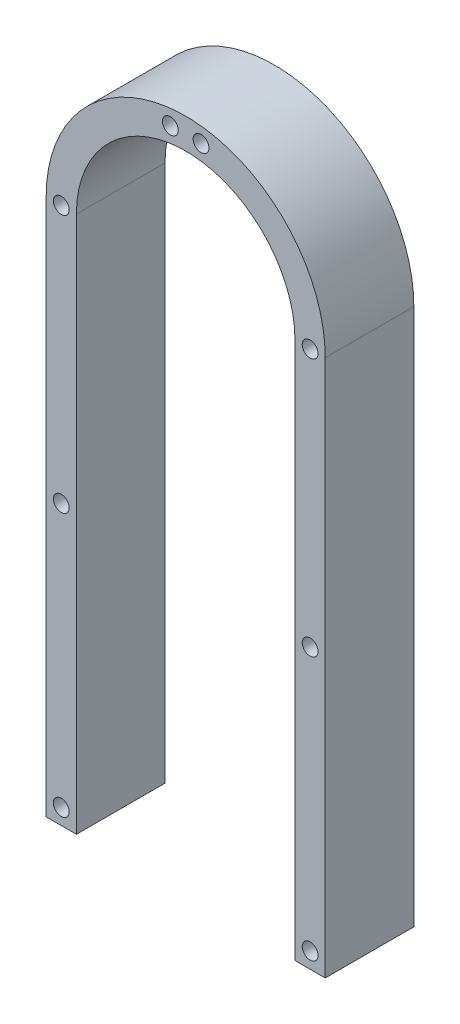
ISO-10303-21;
HEADER;
FILE_DESCRIPTION(('STEP AP214'),'2;1');
FILE_NAME('part.step','',(''),(''),'','','');
FILE_SCHEMA(('AUTOMOTIVE_DESIGN { 1 0 10303 214 1 1 1 1 }'));
ENDSEC;
DATA;
#1=APPLICATION_CONTEXT('core data for automotive mechanical design processes');
#2=APPLICATION_PROTOCOL_DEFINITION('international standard','automotive_design',2000,#1);
#3=PRODUCT_CONTEXT('',#1,'mechanical');
#4=PRODUCT('Part','Part','',(#3));
#5=PRODUCT_RELATED_PRODUCT_CATEGORY('part','',(#4));
#6=PRODUCT_DEFINITION_FORMATION('','',#4);
#7=PRODUCT_DEFINITION_CONTEXT('part definition',#1,'design');
#8=PRODUCT_DEFINITION('design','',#6,#7);
#9=PRODUCT_DEFINITION_SHAPE('','',#8);
#10=(LENGTH_UNIT() NAMED_UNIT(*) SI_UNIT(.MILLI.,.METRE.));
#11=(NAMED_UNIT(*) PLANE_ANGLE_UNIT() SI_UNIT($,.RADIAN.));
#12=(NAMED_UNIT(*) SI_UNIT($,.STERADIAN.) SOLID_ANGLE_UNIT());
#13=UNCERTAINTY_MEASURE_WITH_UNIT(LENGTH_MEASURE(1.E-05),#10,'distance_accuracy_value','');
#14=(GEOMETRIC_REPRESENTATION_CONTEXT(3) GLOBAL_UNCERTAINTY_ASSIGNED_CONTEXT((#13)) GLOBAL_UNIT_ASSIGNED_CONTEXT((#10,
#11,#12)) REPRESENTATION_CONTEXT('',''));
#15=CARTESIAN_POINT('',(0.,0.,0.));
#16=DIRECTION('',(0.,0.,1.));
#17=DIRECTION('',(1.,0.,0.));
#18=AXIS2_PLACEMENT_3D('',#15,#16,#17);
#19=CARTESIAN_POINT('',(-149.085368150531,-18.7891941834329,19.05));
#20=DIRECTION('',(0.,0.,1.));
#21=DIRECTION('',(1.,0.,0.));
#22=AXIS2_PLACEMENT_3D('',#19,#20,#21);
#23=PLANE('',#22);
#24=DIRECTION('',(-1.,0.,0.));
#25=VECTOR('',#24,1.);
#26=CARTESIAN_POINT('',(-149.085368150531,96.6995702810626,19.05));
#27=LINE('',#26,#25);
#28=CARTESIAN_POINT('',(-119.085368150531,96.6995702810626,19.05));
#29=VERTEX_POINT('',#28);
#30=CARTESIAN_POINT('',(-125.585368150531,96.6995702810626,19.05));
#31=VERTEX_POINT('',#30);
#32=EDGE_CURVE('E50',#29,#31,#27,.T.);
#33=ORIENTED_EDGE('',*,*,#32,.F.);
#34=DIRECTION('',(0.,1.,0.));
#35=VECTOR('',#34,1.);
#36=CARTESIAN_POINT('',(-119.085368150531,-18.7891941834329,19.05));
#37=LINE('',#36,#35);
#38=CARTESIAN_POINT('',(-119.085368150531,212.188334745558,19.05));
#39=VERTEX_POINT('',#38);
#40=EDGE_CURVE('E110',#29,#39,#37,.T.);
#41=ORIENTED_EDGE('',*,*,#40,.T.);
#42=CARTESIAN_POINT('',(-149.085368150531,212.188334745558,19.05));
#43=DIRECTION('',(0.,0.,1.));
#44=DIRECTION('',(1.,0.,0.));
#45=AXIS2_PLACEMENT_3D('',#42,#43,#44);
#46=CIRCLE('',#45,30.);
#47=CARTESIAN_POINT('',(-179.085368150531,212.188334745558,19.05));
#48=VERTEX_POINT('',#47);
#49=EDGE_CURVE('E118',#39,#48,#46,.T.);
#50=ORIENTED_EDGE('',*,*,#49,.T.);
#51=DIRECTION('',(0.,-1.,0.));
#52=VECTOR('',#51,1.);
#53=CARTESIAN_POINT('',(-179.085368150531,-18.7891941834329,19.05));
#54=LINE('',#53,#52);
#55=CARTESIAN_POINT('',(-179.085368150531,96.6995702810626,19.05));
#56=VERTEX_POINT('',#55);
#57=EDGE_CURVE('E121',#48,#56,#54,.T.);
#58=ORIENTED_EDGE('',*,*,#57,.T.);
#59=CARTESIAN_POINT('',(-172.585368150531,96.6995702810626,19.05));
#60=VERTEX_POINT('',#59);
#61=EDGE_CURVE('E114',#60,#56,#27,.T.);
#62=ORIENTED_EDGE('',*,*,#61,.F.);
#63=DIRECTION('',(0.,-1.,0.));
#64=VECTOR('',#63,1.);
#65=CARTESIAN_POINT('',(-172.585368150531,-18.7891941834329,19.05));
#66=LINE('',#65,#64);
#67=CARTESIAN_POINT('',(-172.585368150531,212.188334745558,19.05));
#68=VERTEX_POINT('',#67);
#69=EDGE_CURVE('E152',#68,#60,#66,.T.);
#70=ORIENTED_EDGE('',*,*,#69,.F.);
#71=CARTESIAN_POINT('',(-149.085368150531,212.188334745558,19.05));
#72=DIRECTION('',(0.,0.,1.));
#73=DIRECTION('',(1.,0.,0.));
#74=AXIS2_PLACEMENT_3D('',#71,#72,#73);
#75=CIRCLE('',#74,23.5);
#76=CARTESIAN_POINT('',(-125.585368150531,212.188334745558,19.05));
#77=VERTEX_POINT('',#76);
#78=EDGE_CURVE('E158',#77,#68,#75,.T.);
#79=ORIENTED_EDGE('',*,*,#78,.F.);
#80=DIRECTION('',(0.,1.,0.));
#81=VECTOR('',#80,1.);
#82=CARTESIAN_POINT('',(-125.585368150531,-18.7891941834329,19.05));
#83=LINE('',#82,#81);
#84=EDGE_CURVE('E113',#31,#77,#83,.T.);
#85=ORIENTED_EDGE('',*,*,#84,.F.);
#86=EDGE_LOOP('',(#33,#41,#50,#58,#62,#70,#79,#85));
#87=FACE_BOUND('',#86,.T.);
#88=CARTESIAN_POINT('',(-122.335368150531,100.099570281063,19.05));
#89=DIRECTION('',(0.,0.,1.));
#90=DIRECTION('',(1.,0.,0.));
#91=AXIS2_PLACEMENT_3D('',#88,#89,#90);
#92=CIRCLE('',#91,1.7);
#93=CARTESIAN_POINT('',(-120.635368150531,100.099570281063,19.05));
#94=VERTEX_POINT('',#93);
#95=EDGE_CURVE('E104',#94,#94,#92,.T.);
#96=ORIENTED_EDGE('',*,*,#95,.F.);
#97=EDGE_LOOP('',(#96));
#98=FACE_BOUND('',#97,.T.);
#99=CARTESIAN_POINT('',(-152.385368150531,238.734002942083,19.05));
#100=DIRECTION('',(0.,0.,1.));
#101=DIRECTION('',(1.,0.,0.));
#102=AXIS2_PLACEMENT_3D('',#99,#100,#101);
#103=CIRCLE('',#102,1.70000000000001);
#104=CARTESIAN_POINT('',(-150.685368150531,238.734002942083,19.05));
#105=VERTEX_POINT('',#104);
#106=EDGE_CURVE('E210',#105,#105,#103,.T.);
#107=ORIENTED_EDGE('',*,*,#106,.F.);
#108=EDGE_LOOP('',(#107));
#109=FACE_BOUND('',#108,.T.);
#110=CARTESIAN_POINT('',(-122.335368150531,156.699570281063,19.05));
#111=DIRECTION('',(0.,0.,1.));
#112=DIRECTION('',(1.,0.,0.));
#113=AXIS2_PLACEMENT_3D('',#110,#111,#112);
#114=CIRCLE('',#113,1.7);
#115=CARTESIAN_POINT('',(-120.635368150531,156.699570281063,19.05));
#116=VERTEX_POINT('',#115);
#117=EDGE_CURVE('E204',#116,#116,#114,.T.);
#118=ORIENTED_EDGE('',*,*,#117,.F.);
#119=EDGE_LOOP('',(#118));
#120=FACE_BOUND('',#119,.T.);
#121=CARTESIAN_POINT('',(-175.835368150531,156.699570281063,19.05));
#122=DIRECTION('',(0.,0.,1.));
#123=DIRECTION('',(1.,0.,0.));
#124=AXIS2_PLACEMENT_3D('',#121,#122,#123);
#125=CIRCLE('',#124,1.70000000000001);
#126=CARTESIAN_POINT('',(-174.135368150531,156.699570281063,19.05));
#127=VERTEX_POINT('',#126);
#128=EDGE_CURVE('E198',#127,#127,#125,.T.);
#129=ORIENTED_EDGE('',*,*,#128,.F.);
#130=EDGE_LOOP('',(#129));
#131=FACE_BOUND('',#130,.T.);
#132=CARTESIAN_POINT('',(-175.835368150531,100.099570281063,19.05));
#133=DIRECTION('',(0.,0.,1.));
#134=DIRECTION('',(1.,0.,0.));
#135=AXIS2_PLACEMENT_3D('',#132,#133,#134);
#136=CIRCLE('',#135,1.70000000000001);
#137=CARTESIAN_POINT('',(-174.135368150531,100.099570281063,19.05));
#138=VERTEX_POINT('',#137);
#139=EDGE_CURVE('E192',#138,#138,#136,.T.);
#140=ORIENTED_EDGE('',*,*,#139,.F.);
#141=EDGE_LOOP('',(#140));
#142=FACE_BOUND('',#141,.T.);
#143=CARTESIAN_POINT('',(-175.835368150529,212.188334745556,19.05));
#144=DIRECTION('',(0.,0.,1.));
#145=DIRECTION('',(1.,0.,0.));
#146=AXIS2_PLACEMENT_3D('',#143,#144,#145);
#147=CIRCLE('',#146,1.70000000000001);
#148=CARTESIAN_POINT('',(-174.135368150529,212.188334745556,19.05));
#149=VERTEX_POINT('',#148);
#150=EDGE_CURVE('E186',#149,#149,#147,.T.);
#151=ORIENTED_EDGE('',*,*,#150,.F.);
#152=EDGE_LOOP('',(#151));
#153=FACE_BOUND('',#152,.T.);
#154=CARTESIAN_POINT('',(-122.335368150529,212.18833474556,19.05));
#155=DIRECTION('',(0.,0.,1.));
#156=DIRECTION('',(1.,0.,0.));
#157=AXIS2_PLACEMENT_3D('',#154,#155,#156);
#158=CIRCLE('',#157,1.7);
#159=CARTESIAN_POINT('',(-120.635368150529,212.18833474556,19.05));
#160=VERTEX_POINT('',#159);
#161=EDGE_CURVE('E180',#160,#160,#158,.T.);
#162=ORIENTED_EDGE('',*,*,#161,.F.);
#163=EDGE_LOOP('',(#162));
#164=FACE_BOUND('',#163,.T.);
#165=CARTESIAN_POINT('',(-145.785368150531,238.734002942083,19.05));
#166=DIRECTION('',(0.,0.,1.));
#167=DIRECTION('',(1.,0.,0.));
#168=AXIS2_PLACEMENT_3D('',#165,#166,#167);
#169=CIRCLE('',#168,1.70000000000001);
#170=CARTESIAN_POINT('',(-144.085368150531,238.734002942083,19.05));
#171=VERTEX_POINT('',#170);
#172=EDGE_CURVE('E174',#171,#171,#169,.T.);
#173=ORIENTED_EDGE('',*,*,#172,.F.);
#174=EDGE_LOOP('',(#173));
#175=FACE_BOUND('',#174,.T.);
#176=ADVANCED_FACE('F35',(#87,#98,#109,#120,#131,#142,#153,#164,#175),#23,.T.);
#177=CARTESIAN_POINT('',(-149.085368150531,-18.7891941834329,0.));
#178=DIRECTION('',(0.,0.,1.));
#179=DIRECTION('',(1.,0.,0.));
#180=AXIS2_PLACEMENT_3D('',#177,#178,#179);
#181=PLANE('',#180);
#182=CARTESIAN_POINT('',(-122.335368150531,100.099570281063,0.));
#183=DIRECTION('',(0.,0.,1.));
#184=DIRECTION('',(1.,0.,0.));
#185=AXIS2_PLACEMENT_3D('',#182,#183,#184);
#186=CIRCLE('',#185,1.7);
#187=CARTESIAN_POINT('',(-120.635368150531,100.099570281063,0.));
#188=VERTEX_POINT('',#187);
#189=EDGE_CURVE('E213',#188,#188,#186,.T.);
#190=ORIENTED_EDGE('',*,*,#189,.T.);
#191=EDGE_LOOP('',(#190));
#192=FACE_BOUND('',#191,.T.);
#193=CARTESIAN_POINT('',(-152.385368150531,238.734002942083,0.));
#194=DIRECTION('',(0.,0.,1.));
#195=DIRECTION('',(1.,0.,0.));
#196=AXIS2_PLACEMENT_3D('',#193,#194,#195);
#197=CIRCLE('',#196,1.70000000000001);
#198=CARTESIAN_POINT('',(-150.685368150531,238.734002942083,0.));
#199=VERTEX_POINT('',#198);
#200=EDGE_CURVE('E207',#199,#199,#197,.T.);
#201=ORIENTED_EDGE('',*,*,#200,.T.);
#202=EDGE_LOOP('',(#201));
#203=FACE_BOUND('',#202,.T.);
#204=CARTESIAN_POINT('',(-122.335368150531,156.699570281063,0.));
#205=DIRECTION('',(0.,0.,1.));
#206=DIRECTION('',(1.,0.,0.));
#207=AXIS2_PLACEMENT_3D('',#204,#205,#206);
#208=CIRCLE('',#207,1.7);
#209=CARTESIAN_POINT('',(-120.635368150531,156.699570281063,0.));
#210=VERTEX_POINT('',#209);
#211=EDGE_CURVE('E201',#210,#210,#208,.T.);
#212=ORIENTED_EDGE('',*,*,#211,.T.);
#213=EDGE_LOOP('',(#212));
#214=FACE_BOUND('',#213,.T.);
#215=CARTESIAN_POINT('',(-175.835368150531,156.699570281063,0.));
#216=DIRECTION('',(0.,0.,1.));
#217=DIRECTION('',(1.,0.,0.));
#218=AXIS2_PLACEMENT_3D('',#215,#216,#217);
#219=CIRCLE('',#218,1.70000000000001);
#220=CARTESIAN_POINT('',(-174.135368150531,156.699570281063,0.));
#221=VERTEX_POINT('',#220);
#222=EDGE_CURVE('E195',#221,#221,#219,.T.);
#223=ORIENTED_EDGE('',*,*,#222,.T.);
#224=EDGE_LOOP('',(#223));
#225=FACE_BOUND('',#224,.T.);
#226=CARTESIAN_POINT('',(-175.835368150531,100.099570281063,0.));
#227=DIRECTION('',(0.,0.,1.));
#228=DIRECTION('',(1.,0.,0.));
#229=AXIS2_PLACEMENT_3D('',#226,#227,#228);
#230=CIRCLE('',#229,1.70000000000001);
#231=CARTESIAN_POINT('',(-174.135368150531,100.099570281063,0.));
#232=VERTEX_POINT('',#231);
#233=EDGE_CURVE('E189',#232,#232,#230,.T.);
#234=ORIENTED_EDGE('',*,*,#233,.T.);
#235=EDGE_LOOP('',(#234));
#236=FACE_BOUND('',#235,.T.);
#237=CARTESIAN_POINT('',(-175.835368150529,212.188334745556,0.));
#238=DIRECTION('',(0.,0.,1.));
#239=DIRECTION('',(1.,0.,0.));
#240=AXIS2_PLACEMENT_3D('',#237,#238,#239);
#241=CIRCLE('',#240,1.70000000000001);
#242=CARTESIAN_POINT('',(-174.135368150529,212.188334745556,0.));
#243=VERTEX_POINT('',#242);
#244=EDGE_CURVE('E183',#243,#243,#241,.T.);
#245=ORIENTED_EDGE('',*,*,#244,.T.);
#246=EDGE_LOOP('',(#245));
#247=FACE_BOUND('',#246,.T.);
#248=CARTESIAN_POINT('',(-122.335368150529,212.18833474556,0.));
#249=DIRECTION('',(0.,0.,1.));
#250=DIRECTION('',(1.,0.,0.));
#251=AXIS2_PLACEMENT_3D('',#248,#249,#250);
#252=CIRCLE('',#251,1.7);
#253=CARTESIAN_POINT('',(-120.635368150529,212.18833474556,0.));
#254=VERTEX_POINT('',#253);
#255=EDGE_CURVE('E177',#254,#254,#252,.T.);
#256=ORIENTED_EDGE('',*,*,#255,.T.);
#257=EDGE_LOOP('',(#256));
#258=FACE_BOUND('',#257,.T.);
#259=CARTESIAN_POINT('',(-145.785368150531,238.734002942083,0.));
#260=DIRECTION('',(0.,0.,1.));
#261=DIRECTION('',(1.,0.,0.));
#262=AXIS2_PLACEMENT_3D('',#259,#260,#261);
#263=CIRCLE('',#262,1.70000000000001);
#264=CARTESIAN_POINT('',(-144.085368150531,238.734002942083,0.));
#265=VERTEX_POINT('',#264);
#266=EDGE_CURVE('E166',#265,#265,#263,.T.);
#267=ORIENTED_EDGE('',*,*,#266,.T.);
#268=EDGE_LOOP('',(#267));
#269=FACE_BOUND('',#268,.T.);
#270=DIRECTION('',(0.,1.,0.));
#271=VECTOR('',#270,1.);
#272=CARTESIAN_POINT('',(-119.085368150531,-18.7891941834329,0.));
#273=LINE('',#272,#271);
#274=CARTESIAN_POINT('',(-119.085368150531,96.6995702810626,0.));
#275=VERTEX_POINT('',#274);
#276=CARTESIAN_POINT('',(-119.085368150531,212.188334745558,0.));
#277=VERTEX_POINT('',#276);
#278=EDGE_CURVE('E133',#275,#277,#273,.T.);
#279=ORIENTED_EDGE('',*,*,#278,.F.);
#280=DIRECTION('',(-1.,0.,0.));
#281=VECTOR('',#280,1.);
#282=CARTESIAN_POINT('',(-149.085368150531,96.6995702810626,0.));
#283=LINE('',#282,#281);
#284=CARTESIAN_POINT('',(-125.585368150531,96.6995702810626,0.));
#285=VERTEX_POINT('',#284);
#286=EDGE_CURVE('E100',#275,#285,#283,.T.);
#287=ORIENTED_EDGE('',*,*,#286,.T.);
#288=DIRECTION('',(0.,1.,0.));
#289=VECTOR('',#288,1.);
#290=CARTESIAN_POINT('',(-125.585368150531,-18.7891941834329,0.));
#291=LINE('',#290,#289);
#292=CARTESIAN_POINT('',(-125.585368150531,212.188334745558,0.));
#293=VERTEX_POINT('',#292);
#294=EDGE_CURVE('E163',#285,#293,#291,.T.);
#295=ORIENTED_EDGE('',*,*,#294,.T.);
#296=CARTESIAN_POINT('',(-149.085368150531,212.188334745558,0.));
#297=DIRECTION('',(0.,0.,1.));
#298=DIRECTION('',(1.,0.,0.));
#299=AXIS2_PLACEMENT_3D('',#296,#297,#298);
#300=CIRCLE('',#299,23.5);
#301=CARTESIAN_POINT('',(-172.585368150531,212.188334745558,0.));
#302=VERTEX_POINT('',#301);
#303=EDGE_CURVE('E165',#293,#302,#300,.T.);
#304=ORIENTED_EDGE('',*,*,#303,.T.);
#305=DIRECTION('',(0.,-1.,0.));
#306=VECTOR('',#305,1.);
#307=CARTESIAN_POINT('',(-172.585368150531,-18.7891941834329,0.));
#308=LINE('',#307,#306);
#309=CARTESIAN_POINT('',(-172.585368150531,96.6995702810626,0.));
#310=VERTEX_POINT('',#309);
#311=EDGE_CURVE('E169',#302,#310,#308,.T.);
#312=ORIENTED_EDGE('',*,*,#311,.T.);
#313=CARTESIAN_POINT('',(-179.085368150531,96.6995702810626,0.));
#314=VERTEX_POINT('',#313);
#315=EDGE_CURVE('E57',#310,#314,#283,.T.);
#316=ORIENTED_EDGE('',*,*,#315,.T.);
#317=DIRECTION('',(0.,-1.,0.));
#318=VECTOR('',#317,1.);
#319=CARTESIAN_POINT('',(-179.085368150531,-18.7891941834329,0.));
#320=LINE('',#319,#318);
#321=CARTESIAN_POINT('',(-179.085368150531,212.188334745558,0.));
#322=VERTEX_POINT('',#321);
#323=EDGE_CURVE('E119',#322,#314,#320,.T.);
#324=ORIENTED_EDGE('',*,*,#323,.F.);
#325=CARTESIAN_POINT('',(-149.085368150531,212.188334745558,0.));
#326=DIRECTION('',(0.,0.,1.));
#327=DIRECTION('',(1.,0.,0.));
#328=AXIS2_PLACEMENT_3D('',#325,#326,#327);
#329=CIRCLE('',#328,30.);
#330=EDGE_CURVE('E124',#277,#322,#329,.T.);
#331=ORIENTED_EDGE('',*,*,#330,.F.);
#332=EDGE_LOOP('',(#279,#287,#295,#304,#312,#316,#324,#331));
#333=FACE_BOUND('',#332,.T.);
#334=ADVANCED_FACE('F143',(#192,#203,#214,#225,#236,#247,#258,#269,#333),#181,.F.);
#335=CARTESIAN_POINT('',(-119.085368150531,-18.7891941834329,19.05));
#336=DIRECTION('',(-1.,0.,0.));
#337=DIRECTION('',(0.,0.,1.));
#338=AXIS2_PLACEMENT_3D('',#335,#336,#337);
#339=PLANE('',#338);
#340=ORIENTED_EDGE('',*,*,#40,.F.);
#341=DIRECTION('',(0.,0.,-1.));
#342=VECTOR('',#341,1.);
#343=CARTESIAN_POINT('',(-119.085368150531,96.6995702810626,19.05));
#344=LINE('',#343,#342);
#345=EDGE_CURVE('E97',#29,#275,#344,.T.);
#346=ORIENTED_EDGE('',*,*,#345,.T.);
#347=ORIENTED_EDGE('',*,*,#278,.T.);
#348=DIRECTION('',(0.,0.,-1.));
#349=VECTOR('',#348,1.);
#350=CARTESIAN_POINT('',(-119.085368150531,212.188334745558,19.05));
#351=LINE('',#350,#349);
#352=EDGE_CURVE('E43',#39,#277,#351,.T.);
#353=ORIENTED_EDGE('',*,*,#352,.F.);
#354=EDGE_LOOP('',(#340,#346,#347,#353));
#355=FACE_BOUND('',#354,.T.);
#356=ADVANCED_FACE('F37',(#355),#339,.F.);
#357=CARTESIAN_POINT('',(-149.085368150531,212.188334745558,19.05));
#358=DIRECTION('',(0.,0.,-1.));
#359=DIRECTION('',(-1.,0.,0.));
#360=AXIS2_PLACEMENT_3D('',#357,#358,#359);
#361=CYLINDRICAL_SURFACE('',#360,30.);
#362=ORIENTED_EDGE('',*,*,#330,.T.);
#363=DIRECTION('',(0.,0.,-1.));
#364=VECTOR('',#363,1.);
#365=CARTESIAN_POINT('',(-179.085368150531,212.188334745558,19.05));
#366=LINE('',#365,#364);
#367=EDGE_CURVE('E132',#48,#322,#366,.T.);
#368=ORIENTED_EDGE('',*,*,#367,.F.);
#369=ORIENTED_EDGE('',*,*,#49,.F.);
#370=ORIENTED_EDGE('',*,*,#352,.T.);
#371=EDGE_LOOP('',(#362,#368,#369,#370));
#372=FACE_BOUND('',#371,.T.);
#373=ADVANCED_FACE('F139',(#372),#361,.T.);
#374=CARTESIAN_POINT('',(-179.085368150531,-18.7891941834329,19.05));
#375=DIRECTION('',(1.,0.,0.));
#376=DIRECTION('',(0.,0.,-1.));
#377=AXIS2_PLACEMENT_3D('',#374,#375,#376);
#378=PLANE('',#377);
#379=ORIENTED_EDGE('',*,*,#323,.T.);
#380=DIRECTION('',(0.,0.,1.));
#381=VECTOR('',#380,1.);
#382=CARTESIAN_POINT('',(-179.085368150531,96.6995702810626,19.05));
#383=LINE('',#382,#381);
#384=EDGE_CURVE('E105',#314,#56,#383,.T.);
#385=ORIENTED_EDGE('',*,*,#384,.T.);
#386=ORIENTED_EDGE('',*,*,#57,.F.);
#387=ORIENTED_EDGE('',*,*,#367,.T.);
#388=EDGE_LOOP('',(#379,#385,#386,#387));
#389=FACE_BOUND('',#388,.T.);
#390=ADVANCED_FACE('F147',(#389),#378,.F.);
#391=CARTESIAN_POINT('',(-125.585368150531,-18.7891941834329,19.05));
#392=DIRECTION('',(-1.,0.,0.));
#393=DIRECTION('',(0.,-1.,0.));
#394=AXIS2_PLACEMENT_3D('',#391,#392,#393);
#395=PLANE('',#394);
#396=DIRECTION('',(0.,0.,-1.));
#397=VECTOR('',#396,1.);
#398=CARTESIAN_POINT('',(-125.585368150531,96.6995702810626,19.05));
#399=LINE('',#398,#397);
#400=EDGE_CURVE('E221',#31,#285,#399,.T.);
#401=ORIENTED_EDGE('',*,*,#400,.F.);
#402=ORIENTED_EDGE('',*,*,#84,.T.);
#403=DIRECTION('',(0.,0.,-1.));
#404=VECTOR('',#403,1.);
#405=CARTESIAN_POINT('',(-125.585368150531,212.188334745558,19.05));
#406=LINE('',#405,#404);
#407=EDGE_CURVE('E127',#77,#293,#406,.T.);
#408=ORIENTED_EDGE('',*,*,#407,.T.);
#409=ORIENTED_EDGE('',*,*,#294,.F.);
#410=EDGE_LOOP('',(#401,#402,#408,#409));
#411=FACE_BOUND('',#410,.T.);
#412=ADVANCED_FACE('F224',(#411),#395,.T.);
#413=CARTESIAN_POINT('',(-149.085368150531,212.188334745558,19.05));
#414=DIRECTION('',(0.,0.,-1.));
#415=DIRECTION('',(-1.,0.,0.));
#416=AXIS2_PLACEMENT_3D('',#413,#414,#415);
#417=CYLINDRICAL_SURFACE('',#416,23.5);
#418=ORIENTED_EDGE('',*,*,#303,.F.);
#419=ORIENTED_EDGE('',*,*,#407,.F.);
#420=ORIENTED_EDGE('',*,*,#78,.T.);
#421=DIRECTION('',(0.,0.,-1.));
#422=VECTOR('',#421,1.);
#423=CARTESIAN_POINT('',(-172.585368150531,212.188334745558,19.05));
#424=LINE('',#423,#422);
#425=EDGE_CURVE('E156',#68,#302,#424,.T.);
#426=ORIENTED_EDGE('',*,*,#425,.T.);
#427=EDGE_LOOP('',(#418,#419,#420,#426));
#428=FACE_BOUND('',#427,.T.);
#429=ADVANCED_FACE('F227',(#428),#417,.F.);
#430=CARTESIAN_POINT('',(-172.585368150531,-18.7891941834329,19.05));
#431=DIRECTION('',(1.,0.,0.));
#432=DIRECTION('',(0.,1.,0.));
#433=AXIS2_PLACEMENT_3D('',#430,#431,#432);
#434=PLANE('',#433);
#435=DIRECTION('',(0.,0.,1.));
#436=VECTOR('',#435,1.);
#437=CARTESIAN_POINT('',(-172.585368150531,96.6995702810626,19.05));
#438=LINE('',#437,#436);
#439=EDGE_CURVE('E11',#310,#60,#438,.T.);
#440=ORIENTED_EDGE('',*,*,#439,.F.);
#441=ORIENTED_EDGE('',*,*,#311,.F.);
#442=ORIENTED_EDGE('',*,*,#425,.F.);
#443=ORIENTED_EDGE('',*,*,#69,.T.);
#444=EDGE_LOOP('',(#440,#441,#442,#443));
#445=FACE_BOUND('',#444,.T.);
#446=ADVANCED_FACE('F154',(#445),#434,.T.);
#447=CARTESIAN_POINT('',(-145.785368150531,238.734002942083,0.));
#448=DIRECTION('',(0.,0.,1.));
#449=DIRECTION('',(1.,0.,0.));
#450=AXIS2_PLACEMENT_3D('',#447,#448,#449);
#451=CYLINDRICAL_SURFACE('',#450,1.70000000000001);
#452=ORIENTED_EDGE('',*,*,#266,.F.);
#453=EDGE_LOOP('',(#452));
#454=FACE_BOUND('',#453,.T.);
#455=ORIENTED_EDGE('',*,*,#172,.T.);
#456=EDGE_LOOP('',(#455));
#457=FACE_BOUND('',#456,.T.);
#458=ADVANCED_FACE('F234',(#454,#457),#451,.F.);
#459=CARTESIAN_POINT('',(-122.335368150529,212.18833474556,0.));
#460=DIRECTION('',(0.,0.,1.));
#461=DIRECTION('',(1.,0.,0.));
#462=AXIS2_PLACEMENT_3D('',#459,#460,#461);
#463=CYLINDRICAL_SURFACE('',#462,1.7);
#464=ORIENTED_EDGE('',*,*,#255,.F.);
#465=EDGE_LOOP('',(#464));
#466=FACE_BOUND('',#465,.T.);
#467=ORIENTED_EDGE('',*,*,#161,.T.);
#468=EDGE_LOOP('',(#467));
#469=FACE_BOUND('',#468,.T.);
#470=ADVANCED_FACE('F327',(#466,#469),#463,.F.);
#471=CARTESIAN_POINT('',(-175.835368150529,212.188334745556,0.));
#472=DIRECTION('',(0.,0.,1.));
#473=DIRECTION('',(1.,0.,0.));
#474=AXIS2_PLACEMENT_3D('',#471,#472,#473);
#475=CYLINDRICAL_SURFACE('',#474,1.70000000000001);
#476=ORIENTED_EDGE('',*,*,#244,.F.);
#477=EDGE_LOOP('',(#476));
#478=FACE_BOUND('',#477,.T.);
#479=ORIENTED_EDGE('',*,*,#150,.T.);
#480=EDGE_LOOP('',(#479));
#481=FACE_BOUND('',#480,.T.);
#482=ADVANCED_FACE('F317',(#478,#481),#475,.F.);
#483=CARTESIAN_POINT('',(-175.835368150531,100.099570281063,0.));
#484=DIRECTION('',(0.,0.,1.));
#485=DIRECTION('',(1.,0.,0.));
#486=AXIS2_PLACEMENT_3D('',#483,#484,#485);
#487=CYLINDRICAL_SURFACE('',#486,1.70000000000001);
#488=ORIENTED_EDGE('',*,*,#233,.F.);
#489=EDGE_LOOP('',(#488));
#490=FACE_BOUND('',#489,.T.);
#491=ORIENTED_EDGE('',*,*,#139,.T.);
#492=EDGE_LOOP('',(#491));
#493=FACE_BOUND('',#492,.T.);
#494=ADVANCED_FACE('F307',(#490,#493),#487,.F.);
#495=CARTESIAN_POINT('',(-175.835368150531,156.699570281063,0.));
#496=DIRECTION('',(0.,0.,1.));
#497=DIRECTION('',(1.,0.,0.));
#498=AXIS2_PLACEMENT_3D('',#495,#496,#497);
#499=CYLINDRICAL_SURFACE('',#498,1.70000000000001);
#500=ORIENTED_EDGE('',*,*,#222,.F.);
#501=EDGE_LOOP('',(#500));
#502=FACE_BOUND('',#501,.T.);
#503=ORIENTED_EDGE('',*,*,#128,.T.);
#504=EDGE_LOOP('',(#503));
#505=FACE_BOUND('',#504,.T.);
#506=ADVANCED_FACE('F297',(#502,#505),#499,.F.);
#507=CARTESIAN_POINT('',(-122.335368150531,156.699570281063,0.));
#508=DIRECTION('',(0.,0.,1.));
#509=DIRECTION('',(1.,0.,0.));
#510=AXIS2_PLACEMENT_3D('',#507,#508,#509);
#511=CYLINDRICAL_SURFACE('',#510,1.7);
#512=ORIENTED_EDGE('',*,*,#211,.F.);
#513=EDGE_LOOP('',(#512));
#514=FACE_BOUND('',#513,.T.);
#515=ORIENTED_EDGE('',*,*,#117,.T.);
#516=EDGE_LOOP('',(#515));
#517=FACE_BOUND('',#516,.T.);
#518=ADVANCED_FACE('F287',(#514,#517),#511,.F.);
#519=CARTESIAN_POINT('',(-152.385368150531,238.734002942083,0.));
#520=DIRECTION('',(0.,0.,1.));
#521=DIRECTION('',(1.,0.,0.));
#522=AXIS2_PLACEMENT_3D('',#519,#520,#521);
#523=CYLINDRICAL_SURFACE('',#522,1.70000000000001);
#524=ORIENTED_EDGE('',*,*,#200,.F.);
#525=EDGE_LOOP('',(#524));
#526=FACE_BOUND('',#525,.T.);
#527=ORIENTED_EDGE('',*,*,#106,.T.);
#528=EDGE_LOOP('',(#527));
#529=FACE_BOUND('',#528,.T.);
#530=ADVANCED_FACE('F275',(#526,#529),#523,.F.);
#531=CARTESIAN_POINT('',(-122.335368150531,100.099570281063,0.));
#532=DIRECTION('',(0.,0.,1.));
#533=DIRECTION('',(1.,0.,0.));
#534=AXIS2_PLACEMENT_3D('',#531,#532,#533);
#535=CYLINDRICAL_SURFACE('',#534,1.7);
#536=ORIENTED_EDGE('',*,*,#189,.F.);
#537=EDGE_LOOP('',(#536));
#538=FACE_BOUND('',#537,.T.);
#539=ORIENTED_EDGE('',*,*,#95,.T.);
#540=EDGE_LOOP('',(#539));
#541=FACE_BOUND('',#540,.T.);
#542=ADVANCED_FACE('F269',(#538,#541),#535,.F.);
#543=CARTESIAN_POINT('',(-149.085368150531,96.6995702810626,0.));
#544=DIRECTION('',(0.,1.,0.));
#545=DIRECTION('',(0.,0.,1.));
#546=AXIS2_PLACEMENT_3D('',#543,#544,#545);
#547=PLANE('',#546);
#548=ORIENTED_EDGE('',*,*,#315,.F.);
#549=ORIENTED_EDGE('',*,*,#439,.T.);
#550=ORIENTED_EDGE('',*,*,#61,.T.);
#551=ORIENTED_EDGE('',*,*,#384,.F.);
#552=EDGE_LOOP('',(#548,#549,#550,#551));
#553=FACE_BOUND('',#552,.T.);
#554=ADVANCED_FACE('F274',(#553),#547,.F.);
#555=ORIENTED_EDGE('',*,*,#32,.T.);
#556=ORIENTED_EDGE('',*,*,#400,.T.);
#557=ORIENTED_EDGE('',*,*,#286,.F.);
#558=ORIENTED_EDGE('',*,*,#345,.F.);
#559=EDGE_LOOP('',(#555,#556,#557,#558));
#560=FACE_BOUND('',#559,.T.);
#561=ADVANCED_FACE('F98',(#560),#547,.F.);
#562=CLOSED_SHELL('',(#176,#334,#356,#373,#390,#412,#429,#446,#458,#470,#482,#494,#506,#518,
#530,#542,#554,#561));
#563=MANIFOLD_SOLID_BREP('B2',#562);
#564=ADVANCED_BREP_SHAPE_REPRESENTATION('',(#18,#563),#14);
#565=SHAPE_DEFINITION_REPRESENTATION(#9,#564);
ENDSEC;
END-ISO-10303-21;
